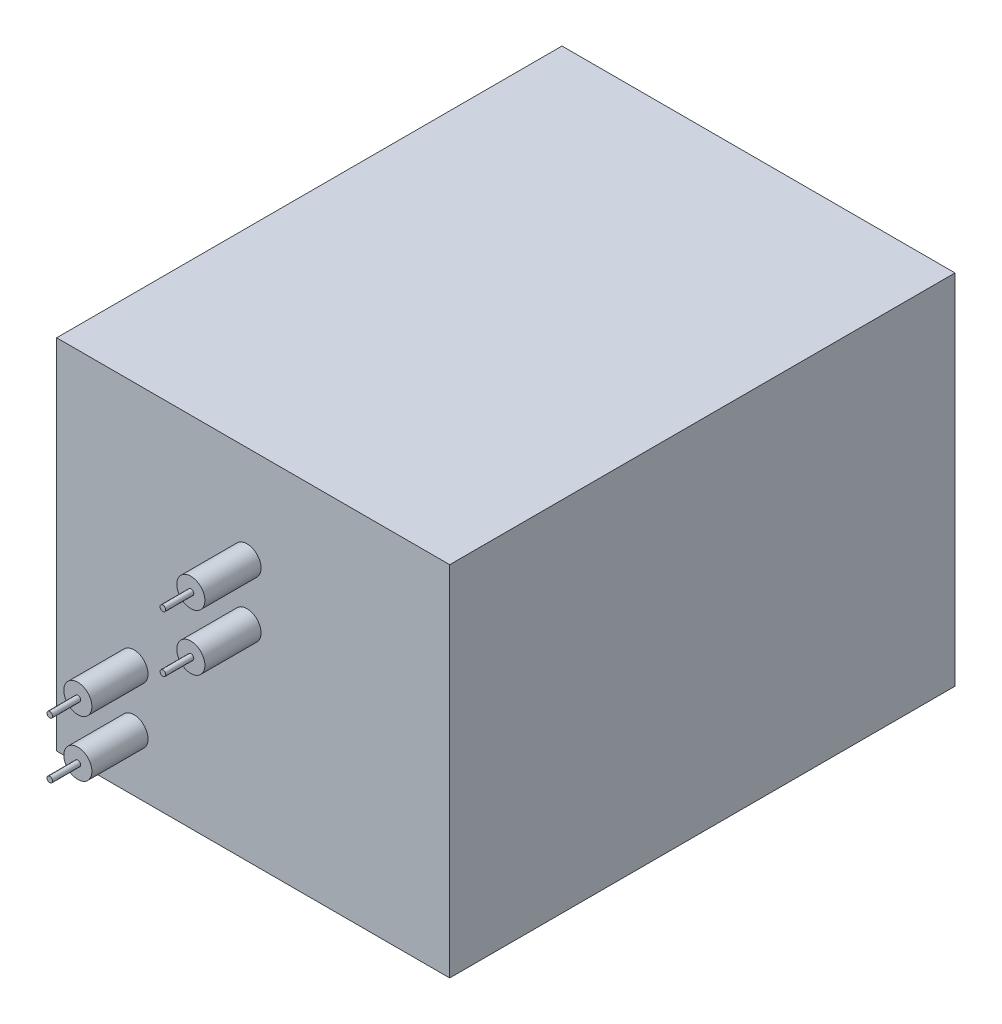
ISO-10303-21;
HEADER;
FILE_DESCRIPTION(('STEP AP214'),'2;1');
FILE_NAME('part.step','',(''),(''),'','','');
FILE_SCHEMA(('AUTOMOTIVE_DESIGN { 1 0 10303 214 1 1 1 1 }'));
ENDSEC;
DATA;
#1=APPLICATION_CONTEXT('core data for automotive mechanical design processes');
#2=APPLICATION_PROTOCOL_DEFINITION('international standard','automotive_design',2000,#1);
#3=PRODUCT_CONTEXT('',#1,'mechanical');
#4=PRODUCT('Part','Part','',(#3));
#5=PRODUCT_RELATED_PRODUCT_CATEGORY('part','',(#4));
#6=PRODUCT_DEFINITION_FORMATION('','',#4);
#7=PRODUCT_DEFINITION_CONTEXT('part definition',#1,'design');
#8=PRODUCT_DEFINITION('design','',#6,#7);
#9=PRODUCT_DEFINITION_SHAPE('','',#8);
#10=(LENGTH_UNIT() NAMED_UNIT(*) SI_UNIT(.MILLI.,.METRE.));
#11=(NAMED_UNIT(*) PLANE_ANGLE_UNIT() SI_UNIT($,.RADIAN.));
#12=(NAMED_UNIT(*) SI_UNIT($,.STERADIAN.) SOLID_ANGLE_UNIT());
#13=UNCERTAINTY_MEASURE_WITH_UNIT(LENGTH_MEASURE(1.E-05),#10,'distance_accuracy_value','');
#14=(GEOMETRIC_REPRESENTATION_CONTEXT(3) GLOBAL_UNCERTAINTY_ASSIGNED_CONTEXT((#13)) GLOBAL_UNIT_ASSIGNED_CONTEXT((#10,
#11,#12)) REPRESENTATION_CONTEXT('',''));
#15=CARTESIAN_POINT('',(0.,0.,0.));
#16=DIRECTION('',(0.,0.,1.));
#17=DIRECTION('',(1.,0.,0.));
#18=AXIS2_PLACEMENT_3D('',#15,#16,#17);
#19=CARTESIAN_POINT('',(88.9,161.925,114.3));
#20=DIRECTION('',(-1.,0.,0.));
#21=DIRECTION('',(0.,0.,1.));
#22=AXIS2_PLACEMENT_3D('',#19,#20,#21);
#23=PLANE('',#22);
#24=DIRECTION('',(0.,0.,-1.));
#25=VECTOR('',#24,1.);
#26=CARTESIAN_POINT('',(88.9,0.,114.3));
#27=LINE('',#26,#25);
#28=CARTESIAN_POINT('',(88.9,0.,114.3));
#29=VERTEX_POINT('',#28);
#30=CARTESIAN_POINT('',(88.9,0.,-114.3));
#31=VERTEX_POINT('',#30);
#32=EDGE_CURVE('E104',#29,#31,#27,.T.);
#33=ORIENTED_EDGE('',*,*,#32,.T.);
#34=DIRECTION('',(0.,-1.,0.));
#35=VECTOR('',#34,1.);
#36=CARTESIAN_POINT('',(88.9,161.925,-114.3));
#37=LINE('',#36,#35);
#38=CARTESIAN_POINT('',(88.9,161.925,-114.3));
#39=VERTEX_POINT('',#38);
#40=EDGE_CURVE('E95',#39,#31,#37,.T.);
#41=ORIENTED_EDGE('',*,*,#40,.F.);
#42=DIRECTION('',(0.,0.,-1.));
#43=VECTOR('',#42,1.);
#44=CARTESIAN_POINT('',(88.9,161.925,114.3));
#45=LINE('',#44,#43);
#46=CARTESIAN_POINT('',(88.9,161.925,114.3));
#47=VERTEX_POINT('',#46);
#48=EDGE_CURVE('E89',#47,#39,#45,.T.);
#49=ORIENTED_EDGE('',*,*,#48,.F.);
#50=DIRECTION('',(0.,-1.,0.));
#51=VECTOR('',#50,1.);
#52=CARTESIAN_POINT('',(88.9,161.925,114.3));
#53=LINE('',#52,#51);
#54=EDGE_CURVE('E100',#47,#29,#53,.T.);
#55=ORIENTED_EDGE('',*,*,#54,.T.);
#56=EDGE_LOOP('',(#33,#41,#49,#55));
#57=FACE_BOUND('',#56,.T.);
#58=ADVANCED_FACE('F35',(#57),#23,.F.);
#59=CARTESIAN_POINT('',(-88.9,161.925,-114.3));
#60=DIRECTION('',(0.,0.,1.));
#61=DIRECTION('',(1.,0.,0.));
#62=AXIS2_PLACEMENT_3D('',#59,#60,#61);
#63=PLANE('',#62);
#64=DIRECTION('',(-1.,0.,0.));
#65=VECTOR('',#64,1.);
#66=CARTESIAN_POINT('',(-88.9,0.,-114.3));
#67=LINE('',#66,#65);
#68=CARTESIAN_POINT('',(-88.9,0.,-114.3));
#69=VERTEX_POINT('',#68);
#70=EDGE_CURVE('E94',#31,#69,#67,.T.);
#71=ORIENTED_EDGE('',*,*,#70,.T.);
#72=DIRECTION('',(0.,-1.,0.));
#73=VECTOR('',#72,1.);
#74=CARTESIAN_POINT('',(-88.9,161.925,-114.3));
#75=LINE('',#74,#73);
#76=CARTESIAN_POINT('',(-88.9,161.925,-114.3));
#77=VERTEX_POINT('',#76);
#78=EDGE_CURVE('E92',#77,#69,#75,.T.);
#79=ORIENTED_EDGE('',*,*,#78,.F.);
#80=DIRECTION('',(-1.,0.,0.));
#81=VECTOR('',#80,1.);
#82=CARTESIAN_POINT('',(-88.9,161.925,-114.3));
#83=LINE('',#82,#81);
#84=EDGE_CURVE('E84',#39,#77,#83,.T.);
#85=ORIENTED_EDGE('',*,*,#84,.F.);
#86=ORIENTED_EDGE('',*,*,#40,.T.);
#87=EDGE_LOOP('',(#71,#79,#85,#86));
#88=FACE_BOUND('',#87,.T.);
#89=ADVANCED_FACE('F93',(#88),#63,.F.);
#90=CARTESIAN_POINT('',(-88.9,161.925,114.3));
#91=DIRECTION('',(1.,0.,0.));
#92=DIRECTION('',(0.,0.,-1.));
#93=AXIS2_PLACEMENT_3D('',#90,#91,#92);
#94=PLANE('',#93);
#95=DIRECTION('',(0.,0.,1.));
#96=VECTOR('',#95,1.);
#97=CARTESIAN_POINT('',(-88.9,0.,114.3));
#98=LINE('',#97,#96);
#99=CARTESIAN_POINT('',(-88.9,0.,114.3));
#100=VERTEX_POINT('',#99);
#101=EDGE_CURVE('E70',#69,#100,#98,.T.);
#102=ORIENTED_EDGE('',*,*,#101,.T.);
#103=DIRECTION('',(0.,-1.,0.));
#104=VECTOR('',#103,1.);
#105=CARTESIAN_POINT('',(-88.9,161.925,114.3));
#106=LINE('',#105,#104);
#107=CARTESIAN_POINT('',(-88.9,161.925,114.3));
#108=VERTEX_POINT('',#107);
#109=EDGE_CURVE('E96',#108,#100,#106,.T.);
#110=ORIENTED_EDGE('',*,*,#109,.F.);
#111=DIRECTION('',(0.,0.,1.));
#112=VECTOR('',#111,1.);
#113=CARTESIAN_POINT('',(-88.9,161.925,114.3));
#114=LINE('',#113,#112);
#115=EDGE_CURVE('E87',#77,#108,#114,.T.);
#116=ORIENTED_EDGE('',*,*,#115,.F.);
#117=ORIENTED_EDGE('',*,*,#78,.T.);
#118=EDGE_LOOP('',(#102,#110,#116,#117));
#119=FACE_BOUND('',#118,.T.);
#120=ADVANCED_FACE('F98',(#119),#94,.F.);
#121=CARTESIAN_POINT('',(-88.9,161.925,114.3));
#122=DIRECTION('',(0.,0.,-1.));
#123=DIRECTION('',(-1.,0.,0.));
#124=AXIS2_PLACEMENT_3D('',#121,#122,#123);
#125=PLANE('',#124);
#126=CARTESIAN_POINT('',(-53.9135820125231,50.8,114.3));
#127=DIRECTION('',(0.,0.,-1.));
#128=DIRECTION('',(-1.,0.,0.));
#129=AXIS2_PLACEMENT_3D('',#126,#127,#128);
#130=CIRCLE('',#129,6.35);
#131=CARTESIAN_POINT('',(-60.2635820125231,50.8,114.3));
#132=VERTEX_POINT('',#131);
#133=EDGE_CURVE('E38',#132,#132,#130,.F.);
#134=ORIENTED_EDGE('',*,*,#133,.F.);
#135=EDGE_LOOP('',(#134));
#136=FACE_BOUND('',#135,.T.);
#137=CARTESIAN_POINT('',(-2.7923369169833,92.507265363164,114.3));
#138=DIRECTION('',(0.,0.,-1.));
#139=DIRECTION('',(-1.,0.,0.));
#140=AXIS2_PLACEMENT_3D('',#137,#138,#139);
#141=CIRCLE('',#140,6.35);
#142=CARTESIAN_POINT('',(-9.1423369169833,92.507265363164,114.3));
#143=VERTEX_POINT('',#142);
#144=EDGE_CURVE('E119',#143,#143,#141,.F.);
#145=ORIENTED_EDGE('',*,*,#144,.F.);
#146=EDGE_LOOP('',(#145));
#147=FACE_BOUND('',#146,.T.);
#148=CARTESIAN_POINT('',(-53.9135820125231,25.4,114.3));
#149=DIRECTION('',(0.,0.,-1.));
#150=DIRECTION('',(-1.,0.,0.));
#151=AXIS2_PLACEMENT_3D('',#148,#149,#150);
#152=CIRCLE('',#151,6.35);
#153=CARTESIAN_POINT('',(-60.2635820125231,25.4,114.3));
#154=VERTEX_POINT('',#153);
#155=EDGE_CURVE('E117',#154,#154,#152,.F.);
#156=ORIENTED_EDGE('',*,*,#155,.F.);
#157=EDGE_LOOP('',(#156));
#158=FACE_BOUND('',#157,.T.);
#159=CARTESIAN_POINT('',(-2.7923369169833,117.907265363164,114.3));
#160=DIRECTION('',(0.,0.,-1.));
#161=DIRECTION('',(-1.,0.,0.));
#162=AXIS2_PLACEMENT_3D('',#159,#160,#161);
#163=CIRCLE('',#162,6.35);
#164=CARTESIAN_POINT('',(-9.1423369169833,117.907265363164,114.3));
#165=VERTEX_POINT('',#164);
#166=EDGE_CURVE('E114',#165,#165,#163,.F.);
#167=ORIENTED_EDGE('',*,*,#166,.F.);
#168=EDGE_LOOP('',(#167));
#169=FACE_BOUND('',#168,.T.);
#170=DIRECTION('',(1.,0.,0.));
#171=VECTOR('',#170,1.);
#172=CARTESIAN_POINT('',(-88.9,0.,114.3));
#173=LINE('',#172,#171);
#174=EDGE_CURVE('E76',#100,#29,#173,.T.);
#175=ORIENTED_EDGE('',*,*,#174,.T.);
#176=ORIENTED_EDGE('',*,*,#54,.F.);
#177=DIRECTION('',(1.,0.,0.));
#178=VECTOR('',#177,1.);
#179=CARTESIAN_POINT('',(-88.9,161.925,114.3));
#180=LINE('',#179,#178);
#181=EDGE_CURVE('E53',#108,#47,#180,.T.);
#182=ORIENTED_EDGE('',*,*,#181,.F.);
#183=ORIENTED_EDGE('',*,*,#109,.T.);
#184=EDGE_LOOP('',(#175,#176,#182,#183));
#185=FACE_BOUND('',#184,.T.);
#186=ADVANCED_FACE('F158',(#136,#147,#158,#169,#185),#125,.F.);
#187=CARTESIAN_POINT('',(0.,161.925,0.));
#188=DIRECTION('',(0.,-1.,0.));
#189=DIRECTION('',(0.,0.,-1.));
#190=AXIS2_PLACEMENT_3D('',#187,#188,#189);
#191=PLANE('',#190);
#192=ORIENTED_EDGE('',*,*,#48,.T.);
#193=ORIENTED_EDGE('',*,*,#84,.T.);
#194=ORIENTED_EDGE('',*,*,#115,.T.);
#195=ORIENTED_EDGE('',*,*,#181,.T.);
#196=EDGE_LOOP('',(#192,#193,#194,#195));
#197=FACE_BOUND('',#196,.T.);
#198=ADVANCED_FACE('F85',(#197),#191,.F.);
#199=CARTESIAN_POINT('',(0.,0.,0.));
#200=DIRECTION('',(0.,-1.,0.));
#201=DIRECTION('',(0.,0.,-1.));
#202=AXIS2_PLACEMENT_3D('',#199,#200,#201);
#203=PLANE('',#202);
#204=ORIENTED_EDGE('',*,*,#32,.F.);
#205=ORIENTED_EDGE('',*,*,#174,.F.);
#206=ORIENTED_EDGE('',*,*,#101,.F.);
#207=ORIENTED_EDGE('',*,*,#70,.F.);
#208=EDGE_LOOP('',(#204,#205,#206,#207));
#209=FACE_BOUND('',#208,.T.);
#210=ADVANCED_FACE('F154',(#209),#203,.T.);
#211=CARTESIAN_POINT('',(-2.7923369169833,117.907265363164,139.7));
#212=DIRECTION('',(0.,0.,-1.));
#213=DIRECTION('',(-1.,0.,0.));
#214=AXIS2_PLACEMENT_3D('',#211,#212,#213);
#215=CYLINDRICAL_SURFACE('',#214,6.35);
#216=CARTESIAN_POINT('',(-2.7923369169833,117.907265363164,139.7));
#217=DIRECTION('',(0.,0.,1.));
#218=DIRECTION('',(1.,0.,0.));
#219=AXIS2_PLACEMENT_3D('',#216,#217,#218);
#220=CIRCLE('',#219,6.35);
#221=CARTESIAN_POINT('',(3.5576630830167,117.907265363164,139.7));
#222=VERTEX_POINT('',#221);
#223=EDGE_CURVE('E107',#222,#222,#220,.T.);
#224=ORIENTED_EDGE('',*,*,#223,.F.);
#225=EDGE_LOOP('',(#224));
#226=FACE_BOUND('',#225,.T.);
#227=ORIENTED_EDGE('',*,*,#166,.T.);
#228=EDGE_LOOP('',(#227));
#229=FACE_BOUND('',#228,.T.);
#230=ADVANCED_FACE('F151',(#226,#229),#215,.T.);
#231=CARTESIAN_POINT('',(-2.7923369169833,117.907265363164,139.7));
#232=DIRECTION('',(0.,0.,1.));
#233=DIRECTION('',(1.,0.,0.));
#234=AXIS2_PLACEMENT_3D('',#231,#232,#233);
#235=PLANE('',#234);
#236=CARTESIAN_POINT('',(-2.73051212499473,118.079738130932,139.7));
#237=DIRECTION('',(0.,0.,1.));
#238=DIRECTION('',(1.,0.,0.));
#239=AXIS2_PLACEMENT_3D('',#236,#237,#238);
#240=CIRCLE('',#239,1.27);
#241=CARTESIAN_POINT('',(-1.46051212499473,118.079738130932,139.7));
#242=VERTEX_POINT('',#241);
#243=EDGE_CURVE('E124',#242,#242,#240,.T.);
#244=ORIENTED_EDGE('',*,*,#243,.F.);
#245=EDGE_LOOP('',(#244));
#246=FACE_BOUND('',#245,.T.);
#247=ORIENTED_EDGE('',*,*,#223,.T.);
#248=EDGE_LOOP('',(#247));
#249=FACE_BOUND('',#248,.T.);
#250=ADVANCED_FACE('F149',(#246,#249),#235,.T.);
#251=CARTESIAN_POINT('',(-53.9135820125231,25.4,139.7));
#252=DIRECTION('',(0.,0.,-1.));
#253=DIRECTION('',(-1.,0.,0.));
#254=AXIS2_PLACEMENT_3D('',#251,#252,#253);
#255=CYLINDRICAL_SURFACE('',#254,6.35);
#256=CARTESIAN_POINT('',(-53.9135820125231,25.4,139.7));
#257=DIRECTION('',(0.,0.,1.));
#258=DIRECTION('',(1.,0.,0.));
#259=AXIS2_PLACEMENT_3D('',#256,#257,#258);
#260=CIRCLE('',#259,6.35);
#261=CARTESIAN_POINT('',(-47.5635820125231,25.4,139.7));
#262=VERTEX_POINT('',#261);
#263=EDGE_CURVE('E143',#262,#262,#260,.T.);
#264=ORIENTED_EDGE('',*,*,#263,.F.);
#265=EDGE_LOOP('',(#264));
#266=FACE_BOUND('',#265,.T.);
#267=ORIENTED_EDGE('',*,*,#155,.T.);
#268=EDGE_LOOP('',(#267));
#269=FACE_BOUND('',#268,.T.);
#270=ADVANCED_FACE('F183',(#266,#269),#255,.T.);
#271=CARTESIAN_POINT('',(-53.9135820125231,25.4,139.7));
#272=DIRECTION('',(0.,0.,1.));
#273=DIRECTION('',(1.,0.,0.));
#274=AXIS2_PLACEMENT_3D('',#271,#272,#273);
#275=PLANE('',#274);
#276=CARTESIAN_POINT('',(-53.9135820125231,25.4,139.7));
#277=DIRECTION('',(0.,0.,1.));
#278=DIRECTION('',(1.,0.,0.));
#279=AXIS2_PLACEMENT_3D('',#276,#277,#278);
#280=CIRCLE('',#279,1.27);
#281=CARTESIAN_POINT('',(-52.6435820125231,25.4,139.7));
#282=VERTEX_POINT('',#281);
#283=EDGE_CURVE('E11',#282,#282,#280,.T.);
#284=ORIENTED_EDGE('',*,*,#283,.F.);
#285=EDGE_LOOP('',(#284));
#286=FACE_BOUND('',#285,.T.);
#287=ORIENTED_EDGE('',*,*,#263,.T.);
#288=EDGE_LOOP('',(#287));
#289=FACE_BOUND('',#288,.T.);
#290=ADVANCED_FACE('F187',(#286,#289),#275,.T.);
#291=CARTESIAN_POINT('',(-2.7923369169833,92.507265363164,139.7));
#292=DIRECTION('',(0.,0.,-1.));
#293=DIRECTION('',(-1.,0.,0.));
#294=AXIS2_PLACEMENT_3D('',#291,#292,#293);
#295=CYLINDRICAL_SURFACE('',#294,6.35);
#296=CARTESIAN_POINT('',(-2.7923369169833,92.507265363164,139.7));
#297=DIRECTION('',(0.,0.,1.));
#298=DIRECTION('',(1.,0.,0.));
#299=AXIS2_PLACEMENT_3D('',#296,#297,#298);
#300=CIRCLE('',#299,6.35);
#301=CARTESIAN_POINT('',(3.5576630830167,92.507265363164,139.7));
#302=VERTEX_POINT('',#301);
#303=EDGE_CURVE('E140',#302,#302,#300,.T.);
#304=ORIENTED_EDGE('',*,*,#303,.F.);
#305=EDGE_LOOP('',(#304));
#306=FACE_BOUND('',#305,.T.);
#307=ORIENTED_EDGE('',*,*,#144,.T.);
#308=EDGE_LOOP('',(#307));
#309=FACE_BOUND('',#308,.T.);
#310=ADVANCED_FACE('F191',(#306,#309),#295,.T.);
#311=CARTESIAN_POINT('',(-2.7923369169833,92.507265363164,139.7));
#312=DIRECTION('',(0.,0.,1.));
#313=DIRECTION('',(1.,0.,0.));
#314=AXIS2_PLACEMENT_3D('',#311,#312,#313);
#315=PLANE('',#314);
#316=CARTESIAN_POINT('',(-2.73051212499473,92.6797381309322,139.7));
#317=DIRECTION('',(0.,0.,1.));
#318=DIRECTION('',(1.,0.,0.));
#319=AXIS2_PLACEMENT_3D('',#316,#317,#318);
#320=CIRCLE('',#319,1.27);
#321=CARTESIAN_POINT('',(-1.46051212499473,92.6797381309322,139.7));
#322=VERTEX_POINT('',#321);
#323=EDGE_CURVE('E128',#322,#322,#320,.T.);
#324=ORIENTED_EDGE('',*,*,#323,.F.);
#325=EDGE_LOOP('',(#324));
#326=FACE_BOUND('',#325,.T.);
#327=ORIENTED_EDGE('',*,*,#303,.T.);
#328=EDGE_LOOP('',(#327));
#329=FACE_BOUND('',#328,.T.);
#330=ADVANCED_FACE('F195',(#326,#329),#315,.T.);
#331=CARTESIAN_POINT('',(-53.9135820125231,50.8,139.7));
#332=DIRECTION('',(0.,0.,-1.));
#333=DIRECTION('',(-1.,0.,0.));
#334=AXIS2_PLACEMENT_3D('',#331,#332,#333);
#335=CYLINDRICAL_SURFACE('',#334,6.35);
#336=CARTESIAN_POINT('',(-53.9135820125231,50.8,139.7));
#337=DIRECTION('',(0.,0.,1.));
#338=DIRECTION('',(1.,0.,0.));
#339=AXIS2_PLACEMENT_3D('',#336,#337,#338);
#340=CIRCLE('',#339,6.35);
#341=CARTESIAN_POINT('',(-47.5635820125231,50.8,139.7));
#342=VERTEX_POINT('',#341);
#343=EDGE_CURVE('E137',#342,#342,#340,.T.);
#344=ORIENTED_EDGE('',*,*,#343,.F.);
#345=EDGE_LOOP('',(#344));
#346=FACE_BOUND('',#345,.T.);
#347=ORIENTED_EDGE('',*,*,#133,.T.);
#348=EDGE_LOOP('',(#347));
#349=FACE_BOUND('',#348,.T.);
#350=ADVANCED_FACE('F199',(#346,#349),#335,.T.);
#351=CARTESIAN_POINT('',(-53.9135820125231,50.8,139.7));
#352=DIRECTION('',(0.,0.,1.));
#353=DIRECTION('',(1.,0.,0.));
#354=AXIS2_PLACEMENT_3D('',#351,#352,#353);
#355=PLANE('',#354);
#356=CARTESIAN_POINT('',(-53.9135820125231,50.8,139.7));
#357=DIRECTION('',(0.,0.,1.));
#358=DIRECTION('',(1.,0.,0.));
#359=AXIS2_PLACEMENT_3D('',#356,#357,#358);
#360=CIRCLE('',#359,1.27);
#361=CARTESIAN_POINT('',(-52.6435820125231,50.8,139.7));
#362=VERTEX_POINT('',#361);
#363=EDGE_CURVE('E44',#362,#362,#360,.T.);
#364=ORIENTED_EDGE('',*,*,#363,.F.);
#365=EDGE_LOOP('',(#364));
#366=FACE_BOUND('',#365,.T.);
#367=ORIENTED_EDGE('',*,*,#343,.T.);
#368=EDGE_LOOP('',(#367));
#369=FACE_BOUND('',#368,.T.);
#370=ADVANCED_FACE('F203',(#366,#369),#355,.T.);
#371=CARTESIAN_POINT('',(-2.73051212499473,118.079738130932,152.4));
#372=DIRECTION('',(0.,0.,-1.));
#373=DIRECTION('',(-1.,0.,0.));
#374=AXIS2_PLACEMENT_3D('',#371,#372,#373);
#375=CYLINDRICAL_SURFACE('',#374,1.27);
#376=CARTESIAN_POINT('',(-2.73051212499473,118.079738130932,152.4));
#377=DIRECTION('',(0.,0.,1.));
#378=DIRECTION('',(1.,0.,0.));
#379=AXIS2_PLACEMENT_3D('',#376,#377,#378);
#380=CIRCLE('',#379,1.27);
#381=CARTESIAN_POINT('',(-1.46051212499473,118.079738130932,152.4));
#382=VERTEX_POINT('',#381);
#383=EDGE_CURVE('E136',#382,#382,#380,.T.);
#384=ORIENTED_EDGE('',*,*,#383,.F.);
#385=EDGE_LOOP('',(#384));
#386=FACE_BOUND('',#385,.T.);
#387=ORIENTED_EDGE('',*,*,#243,.T.);
#388=EDGE_LOOP('',(#387));
#389=FACE_BOUND('',#388,.T.);
#390=ADVANCED_FACE('F207',(#386,#389),#375,.T.);
#391=CARTESIAN_POINT('',(-2.73051212499473,118.079738130932,152.4));
#392=DIRECTION('',(0.,0.,1.));
#393=DIRECTION('',(1.,0.,0.));
#394=AXIS2_PLACEMENT_3D('',#391,#392,#393);
#395=PLANE('',#394);
#396=ORIENTED_EDGE('',*,*,#383,.T.);
#397=EDGE_LOOP('',(#396));
#398=FACE_BOUND('',#397,.T.);
#399=ADVANCED_FACE('F211',(#398),#395,.T.);
#400=CARTESIAN_POINT('',(-2.73051212499473,92.6797381309322,152.4));
#401=DIRECTION('',(0.,0.,-1.));
#402=DIRECTION('',(-1.,0.,0.));
#403=AXIS2_PLACEMENT_3D('',#400,#401,#402);
#404=CYLINDRICAL_SURFACE('',#403,1.27);
#405=CARTESIAN_POINT('',(-2.73051212499473,92.6797381309322,152.4));
#406=DIRECTION('',(0.,0.,1.));
#407=DIRECTION('',(1.,0.,0.));
#408=AXIS2_PLACEMENT_3D('',#405,#406,#407);
#409=CIRCLE('',#408,1.27);
#410=CARTESIAN_POINT('',(-1.46051212499473,92.6797381309322,152.4));
#411=VERTEX_POINT('',#410);
#412=EDGE_CURVE('E247',#411,#411,#409,.T.);
#413=ORIENTED_EDGE('',*,*,#412,.F.);
#414=EDGE_LOOP('',(#413));
#415=FACE_BOUND('',#414,.T.);
#416=ORIENTED_EDGE('',*,*,#323,.T.);
#417=EDGE_LOOP('',(#416));
#418=FACE_BOUND('',#417,.T.);
#419=ADVANCED_FACE('F215',(#415,#418),#404,.T.);
#420=CARTESIAN_POINT('',(-2.73051212499473,92.6797381309322,152.4));
#421=DIRECTION('',(0.,0.,1.));
#422=DIRECTION('',(1.,0.,0.));
#423=AXIS2_PLACEMENT_3D('',#420,#421,#422);
#424=PLANE('',#423);
#425=ORIENTED_EDGE('',*,*,#412,.T.);
#426=EDGE_LOOP('',(#425));
#427=FACE_BOUND('',#426,.T.);
#428=ADVANCED_FACE('F219',(#427),#424,.T.);
#429=CARTESIAN_POINT('',(-53.9135820125231,50.8,152.4));
#430=DIRECTION('',(0.,0.,-1.));
#431=DIRECTION('',(-1.,0.,0.));
#432=AXIS2_PLACEMENT_3D('',#429,#430,#431);
#433=CYLINDRICAL_SURFACE('',#432,1.27);
#434=CARTESIAN_POINT('',(-53.9135820125231,50.8,152.4));
#435=DIRECTION('',(0.,0.,1.));
#436=DIRECTION('',(1.,0.,0.));
#437=AXIS2_PLACEMENT_3D('',#434,#435,#436);
#438=CIRCLE('',#437,1.27);
#439=CARTESIAN_POINT('',(-52.6435820125231,50.8,152.4));
#440=VERTEX_POINT('',#439);
#441=EDGE_CURVE('E244',#440,#440,#438,.T.);
#442=ORIENTED_EDGE('',*,*,#441,.F.);
#443=EDGE_LOOP('',(#442));
#444=FACE_BOUND('',#443,.T.);
#445=ORIENTED_EDGE('',*,*,#363,.T.);
#446=EDGE_LOOP('',(#445));
#447=FACE_BOUND('',#446,.T.);
#448=ADVANCED_FACE('F223',(#444,#447),#433,.T.);
#449=CARTESIAN_POINT('',(-53.9135820125231,50.8,152.4));
#450=DIRECTION('',(0.,0.,1.));
#451=DIRECTION('',(1.,0.,0.));
#452=AXIS2_PLACEMENT_3D('',#449,#450,#451);
#453=PLANE('',#452);
#454=ORIENTED_EDGE('',*,*,#441,.T.);
#455=EDGE_LOOP('',(#454));
#456=FACE_BOUND('',#455,.T.);
#457=ADVANCED_FACE('F227',(#456),#453,.T.);
#458=CARTESIAN_POINT('',(-53.9135820125231,25.4,152.4));
#459=DIRECTION('',(0.,0.,-1.));
#460=DIRECTION('',(-1.,0.,0.));
#461=AXIS2_PLACEMENT_3D('',#458,#459,#460);
#462=CYLINDRICAL_SURFACE('',#461,1.27);
#463=CARTESIAN_POINT('',(-53.9135820125231,25.4,152.4));
#464=DIRECTION('',(0.,0.,1.));
#465=DIRECTION('',(1.,0.,0.));
#466=AXIS2_PLACEMENT_3D('',#463,#464,#465);
#467=CIRCLE('',#466,1.27);
#468=CARTESIAN_POINT('',(-52.6435820125231,25.4,152.4));
#469=VERTEX_POINT('',#468);
#470=EDGE_CURVE('E243',#469,#469,#467,.T.);
#471=ORIENTED_EDGE('',*,*,#470,.F.);
#472=EDGE_LOOP('',(#471));
#473=FACE_BOUND('',#472,.T.);
#474=ORIENTED_EDGE('',*,*,#283,.T.);
#475=EDGE_LOOP('',(#474));
#476=FACE_BOUND('',#475,.T.);
#477=ADVANCED_FACE('F231',(#473,#476),#462,.T.);
#478=CARTESIAN_POINT('',(-53.9135820125231,25.4,152.4));
#479=DIRECTION('',(0.,0.,1.));
#480=DIRECTION('',(1.,0.,0.));
#481=AXIS2_PLACEMENT_3D('',#478,#479,#480);
#482=PLANE('',#481);
#483=ORIENTED_EDGE('',*,*,#470,.T.);
#484=EDGE_LOOP('',(#483));
#485=FACE_BOUND('',#484,.T.);
#486=ADVANCED_FACE('F235',(#485),#482,.T.);
#487=CLOSED_SHELL('',(#58,#89,#120,#186,#198,#210,#230,#250,#270,#290,#310,#330,#350,#370,#390,
#399,#419,#428,#448,#457,#477,#486));
#488=MANIFOLD_SOLID_BREP('B2',#487);
#489=ADVANCED_BREP_SHAPE_REPRESENTATION('',(#18,#488),#14);
#490=SHAPE_DEFINITION_REPRESENTATION(#9,#489);
ENDSEC;
END-ISO-10303-21;
